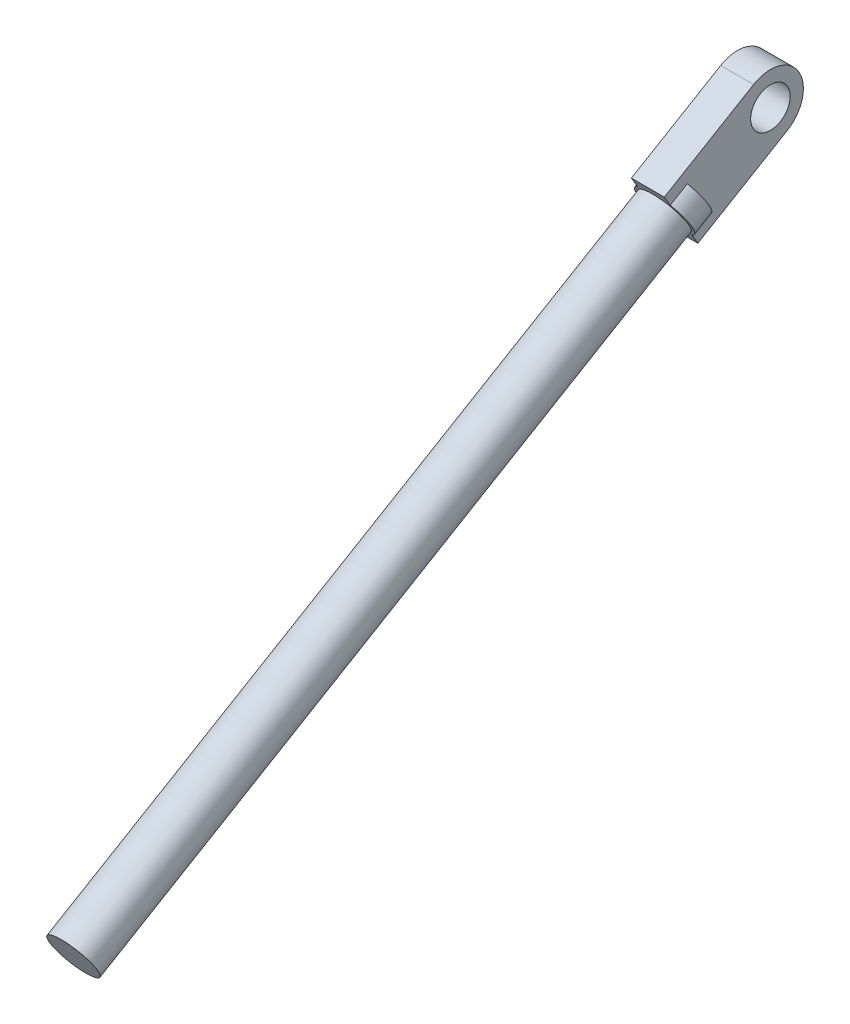
ISO-10303-21;
HEADER;
FILE_DESCRIPTION(('STEP AP214'),'2;1');
FILE_NAME('part.step','',(''),(''),'','','');
FILE_SCHEMA(('AUTOMOTIVE_DESIGN { 1 0 10303 214 1 1 1 1 }'));
ENDSEC;
DATA;
#1=APPLICATION_CONTEXT('core data for automotive mechanical design processes');
#2=APPLICATION_PROTOCOL_DEFINITION('international standard','automotive_design',2000,#1);
#3=PRODUCT_CONTEXT('',#1,'mechanical');
#4=PRODUCT('Part','Part','',(#3));
#5=PRODUCT_RELATED_PRODUCT_CATEGORY('part','',(#4));
#6=PRODUCT_DEFINITION_FORMATION('','',#4);
#7=PRODUCT_DEFINITION_CONTEXT('part definition',#1,'design');
#8=PRODUCT_DEFINITION('design','',#6,#7);
#9=PRODUCT_DEFINITION_SHAPE('','',#8);
#10=(LENGTH_UNIT() NAMED_UNIT(*) SI_UNIT(.MILLI.,.METRE.));
#11=(NAMED_UNIT(*) PLANE_ANGLE_UNIT() SI_UNIT($,.RADIAN.));
#12=(NAMED_UNIT(*) SI_UNIT($,.STERADIAN.) SOLID_ANGLE_UNIT());
#13=UNCERTAINTY_MEASURE_WITH_UNIT(LENGTH_MEASURE(1.E-05),#10,'distance_accuracy_value','');
#14=(GEOMETRIC_REPRESENTATION_CONTEXT(3) GLOBAL_UNCERTAINTY_ASSIGNED_CONTEXT((#13)) GLOBAL_UNIT_ASSIGNED_CONTEXT((#10,
#11,#12)) REPRESENTATION_CONTEXT('',''));
#15=CARTESIAN_POINT('',(0.,0.,0.));
#16=DIRECTION('',(0.,0.,1.));
#17=DIRECTION('',(1.,0.,0.));
#18=AXIS2_PLACEMENT_3D('',#15,#16,#17);
#19=CARTESIAN_POINT('',(2000.00000023834,3731.97065065785,-1839.87329482292));
#20=DIRECTION('',(0.,-0.509636954746252,0.860389548028663));
#21=DIRECTION('',(-1.,0.,0.));
#22=AXIS2_PLACEMENT_3D('',#19,#20,#21);
#23=PLANE('',#22);
#24=DIRECTION('',(0.,-0.860389548028663,-0.509636954746252));
#25=VECTOR('',#24,1.);
#26=CARTESIAN_POINT('',(1950.00000023829,3731.97065065785,-1839.87329482292));
#27=LINE('',#26,#25);
#28=CARTESIAN_POINT('',(1950.00000023829,3787.67578153245,-1806.87731837513));
#29=VERTEX_POINT('',#28);
#30=CARTESIAN_POINT('',(1950.00000023829,3676.26551978325,-1872.8692712707));
#31=VERTEX_POINT('',#30);
#32=EDGE_CURVE('E85',#29,#31,#27,.T.);
#33=ORIENTED_EDGE('',*,*,#32,.T.);
#34=CARTESIAN_POINT('',(2000.00000023834,3731.97065065785,-1839.87329482292));
#35=DIRECTION('',(0.,-0.509636954746252,0.860389548028663));
#36=DIRECTION('',(-1.,0.,0.));
#37=AXIS2_PLACEMENT_3D('',#34,#35,#36);
#38=CIRCLE('',#37,81.8033988750117);
#39=EDGE_CURVE('E19',#29,#31,#38,.T.);
#40=ORIENTED_EDGE('',*,*,#39,.F.);
#41=EDGE_LOOP('',(#33,#40));
#42=FACE_BOUND('',#41,.T.);
#43=ADVANCED_FACE('F16',(#42),#23,.F.);
#44=CARTESIAN_POINT('',(1950.00000023829,3861.92807411815,-2059.27262957024));
#45=DIRECTION('',(-1.,0.,0.));
#46=DIRECTION('',(0.,0.509636954746252,-0.860389548028663));
#47=AXIS2_PLACEMENT_3D('',#44,#45,#46);
#48=CYLINDRICAL_SURFACE('',#47,60.0000000000005);
#49=CARTESIAN_POINT('',(2050.00000023829,3861.92807411815,-2059.27262957024));
#50=DIRECTION('',(-1.,0.,0.));
#51=DIRECTION('',(0.,0.509636954746252,-0.860389548028663));
#52=AXIS2_PLACEMENT_3D('',#49,#50,#51);
#53=CIRCLE('',#52,60.0000000000005);
#54=CARTESIAN_POINT('',(2050.00000023829,3892.50629140292,-2110.89600245196));
#55=VERTEX_POINT('',#54);
#56=EDGE_CURVE('E115',#55,#55,#53,.T.);
#57=ORIENTED_EDGE('',*,*,#56,.F.);
#58=EDGE_LOOP('',(#57));
#59=FACE_BOUND('',#58,.T.);
#60=CARTESIAN_POINT('',(1950.00000023829,3861.92807411815,-2059.27262957024));
#61=DIRECTION('',(-1.,0.,0.));
#62=DIRECTION('',(0.,0.509636954746252,-0.860389548028663));
#63=AXIS2_PLACEMENT_3D('',#60,#61,#62);
#64=CIRCLE('',#63,60.0000000000005);
#65=CARTESIAN_POINT('',(1950.00000023829,3892.50629140292,-2110.89600245196));
#66=VERTEX_POINT('',#65);
#67=EDGE_CURVE('E83',#66,#66,#64,.T.);
#68=ORIENTED_EDGE('',*,*,#67,.T.);
#69=EDGE_LOOP('',(#68));
#70=FACE_BOUND('',#69,.T.);
#71=ADVANCED_FACE('F141',(#59,#70),#48,.F.);
#72=CARTESIAN_POINT('',(1950.00000023829,3861.92807411815,-2059.27262957024));
#73=DIRECTION('',(1.,0.,0.));
#74=DIRECTION('',(0.,-0.509636954746252,0.860389548028663));
#75=AXIS2_PLACEMENT_3D('',#72,#73,#74);
#76=CYLINDRICAL_SURFACE('',#75,99.9999999999996);
#77=CARTESIAN_POINT('',(1950.00000023829,3861.92807411815,-2059.27262957024));
#78=DIRECTION('',(1.,0.,0.));
#79=DIRECTION('',(0.,-0.509636954746252,0.860389548028663));
#80=AXIS2_PLACEMENT_3D('',#77,#78,#79);
#81=CIRCLE('',#80,99.9999999999996);
#82=CARTESIAN_POINT('',(1950.00000023829,3775.88911931528,-2110.23632504486));
#83=VERTEX_POINT('',#82);
#84=CARTESIAN_POINT('',(1950.00000023829,3947.96702892101,-2008.30893409561));
#85=VERTEX_POINT('',#84);
#86=EDGE_CURVE('E95',#83,#85,#81,.T.);
#87=ORIENTED_EDGE('',*,*,#86,.T.);
#88=DIRECTION('',(1.,0.,0.));
#89=VECTOR('',#88,1.);
#90=CARTESIAN_POINT('',(1950.00000023829,3947.96702892101,-2008.30893409561));
#91=LINE('',#90,#89);
#92=CARTESIAN_POINT('',(2050.00000023829,3947.96702892101,-2008.30893409561));
#93=VERTEX_POINT('',#92);
#94=EDGE_CURVE('E84',#93,#85,#91,.F.);
#95=ORIENTED_EDGE('',*,*,#94,.F.);
#96=CARTESIAN_POINT('',(2050.00000023829,3861.92807411815,-2059.27262957024));
#97=DIRECTION('',(1.,0.,0.));
#98=DIRECTION('',(0.,-0.509636954746252,0.860389548028663));
#99=AXIS2_PLACEMENT_3D('',#96,#97,#98);
#100=CIRCLE('',#99,99.9999999999996);
#101=CARTESIAN_POINT('',(2050.00000023829,3775.88911931528,-2110.23632504486));
#102=VERTEX_POINT('',#101);
#103=EDGE_CURVE('E132',#102,#93,#100,.T.);
#104=ORIENTED_EDGE('',*,*,#103,.F.);
#105=DIRECTION('',(1.,0.,0.));
#106=VECTOR('',#105,1.);
#107=CARTESIAN_POINT('',(1950.00000023829,3775.88911931528,-2110.23632504486));
#108=LINE('',#107,#106);
#109=EDGE_CURVE('E118',#83,#102,#108,.T.);
#110=ORIENTED_EDGE('',*,*,#109,.F.);
#111=EDGE_LOOP('',(#87,#95,#104,#110));
#112=FACE_BOUND('',#111,.T.);
#113=ADVANCED_FACE('F144',(#112),#76,.T.);
#114=CARTESIAN_POINT('',(2000.00000023834,3731.97065065785,-1839.87329482292));
#115=DIRECTION('',(0.,-0.509636954746252,0.860389548028663));
#116=DIRECTION('',(-1.,0.,0.));
#117=AXIS2_PLACEMENT_3D('',#114,#115,#116);
#118=PLANE('',#117);
#119=DIRECTION('',(0.,-0.860389548028663,-0.509636954746252));
#120=VECTOR('',#119,1.);
#121=CARTESIAN_POINT('',(2050.00000023829,3731.97065065785,-1839.87329482292));
#122=LINE('',#121,#120);
#123=CARTESIAN_POINT('',(2050.00000023829,3787.67578153252,-1806.8773183751));
#124=VERTEX_POINT('',#123);
#125=CARTESIAN_POINT('',(2050.00000023829,3676.26551978318,-1872.86927127074));
#126=VERTEX_POINT('',#125);
#127=EDGE_CURVE('E112',#124,#126,#122,.T.);
#128=ORIENTED_EDGE('',*,*,#127,.F.);
#129=CARTESIAN_POINT('',(2000.00000023834,3731.97065065785,-1839.87329482292));
#130=DIRECTION('',(0.,-0.509636954746252,0.860389548028663));
#131=DIRECTION('',(-1.,0.,0.));
#132=AXIS2_PLACEMENT_3D('',#129,#130,#131);
#133=CIRCLE('',#132,81.8033988750113);
#134=EDGE_CURVE('E128',#126,#124,#133,.T.);
#135=ORIENTED_EDGE('',*,*,#134,.F.);
#136=EDGE_LOOP('',(#128,#135));
#137=FACE_BOUND('',#136,.T.);
#138=ADVANCED_FACE('F230',(#137),#118,.F.);
#139=CARTESIAN_POINT('',(1950.00000023829,3947.96702892101,-2008.30893409561));
#140=DIRECTION('',(0.,0.860389548028663,0.509636954746252));
#141=DIRECTION('',(0.,-0.509636954746252,0.860389548028663));
#142=AXIS2_PLACEMENT_3D('',#139,#140,#141);
#143=PLANE('',#142);
#144=DIRECTION('',(0.,-0.509636954746252,0.860389548028663));
#145=VECTOR('',#144,1.);
#146=CARTESIAN_POINT('',(1950.00000023829,3947.96702892101,-2008.30893409561));
#147=LINE('',#146,#145);
#148=CARTESIAN_POINT('',(1950.00000023829,3787.43138817594,-1737.28622646657));
#149=VERTEX_POINT('',#148);
#150=EDGE_CURVE('E97',#85,#149,#147,.T.);
#151=ORIENTED_EDGE('',*,*,#150,.T.);
#152=DIRECTION('',(-1.,0.,0.));
#153=VECTOR('',#152,1.);
#154=CARTESIAN_POINT('',(1950.00000023829,3787.43138817594,-1737.28622646657));
#155=LINE('',#154,#153);
#156=CARTESIAN_POINT('',(2050.00000023829,3787.43138817594,-1737.28622646657));
#157=VERTEX_POINT('',#156);
#158=EDGE_CURVE('E105',#157,#149,#155,.T.);
#159=ORIENTED_EDGE('',*,*,#158,.F.);
#160=DIRECTION('',(0.,-0.509636954746252,0.860389548028663));
#161=VECTOR('',#160,1.);
#162=CARTESIAN_POINT('',(2050.00000023829,3947.96702892101,-2008.30893409561));
#163=LINE('',#162,#161);
#164=EDGE_CURVE('E135',#93,#157,#163,.T.);
#165=ORIENTED_EDGE('',*,*,#164,.F.);
#166=ORIENTED_EDGE('',*,*,#94,.T.);
#167=EDGE_LOOP('',(#151,#159,#165,#166));
#168=FACE_BOUND('',#167,.T.);
#169=ADVANCED_FACE('F156',(#168),#143,.T.);
#170=CARTESIAN_POINT('',(2000.00000023834,3731.97065065785,-1839.87329482292));
#171=DIRECTION('',(0.,-0.509636954746252,0.860389548028663));
#172=DIRECTION('',(-1.,0.,0.));
#173=AXIS2_PLACEMENT_3D('',#170,#171,#172);
#174=CYLINDRICAL_SURFACE('',#173,81.8033988750117);
#175=DIRECTION('',(0.,-0.509636954746252,0.860389548028663));
#176=VECTOR('',#175,1.);
#177=CARTESIAN_POINT('',(1950.00000023829,3806.22294324355,-2092.26860601802));
#178=LINE('',#177,#176);
#179=CARTESIAN_POINT('',(1950.00000023829,3645.68730249847,-1821.24589838898));
#180=VERTEX_POINT('',#179);
#181=EDGE_CURVE('E77',#31,#180,#178,.T.);
#182=ORIENTED_EDGE('',*,*,#181,.T.);
#183=CARTESIAN_POINT('',(2000.00000023834,3701.39243337307,-1788.2499219412));
#184=DIRECTION('',(0.,-0.509636954746252,0.860389548028663));
#185=DIRECTION('',(-1.,0.,0.));
#186=AXIS2_PLACEMENT_3D('',#183,#184,#185);
#187=CIRCLE('',#186,81.8033988750117);
#188=CARTESIAN_POINT('',(1950.00000023829,3757.09756424768,-1755.25394549341));
#189=VERTEX_POINT('',#188);
#190=EDGE_CURVE('E126',#189,#180,#187,.T.);
#191=ORIENTED_EDGE('',*,*,#190,.F.);
#192=DIRECTION('',(0.,-0.509636954746252,0.860389548028663));
#193=VECTOR('',#192,1.);
#194=CARTESIAN_POINT('',(1950.00000023829,3917.63320499275,-2026.27665312245));
#195=LINE('',#194,#193);
#196=EDGE_CURVE('E80',#189,#29,#195,.F.);
#197=ORIENTED_EDGE('',*,*,#196,.T.);
#198=ORIENTED_EDGE('',*,*,#39,.T.);
#199=EDGE_LOOP('',(#182,#191,#197,#198));
#200=FACE_BOUND('',#199,.T.);
#201=ADVANCED_FACE('F75',(#200),#174,.T.);
#202=CARTESIAN_POINT('',(1950.00000023829,3861.92807411815,-2059.27262957024));
#203=DIRECTION('',(1.,0.,0.));
#204=DIRECTION('',(0.,-0.509636954746252,0.860389548028663));
#205=AXIS2_PLACEMENT_3D('',#202,#203,#204);
#206=PLANE('',#205);
#207=ORIENTED_EDGE('',*,*,#196,.F.);
#208=DIRECTION('',(0.,-0.860389548028663,-0.509636954746252));
#209=VECTOR('',#208,1.);
#210=CARTESIAN_POINT('',(1950.00000023829,3787.43138817594,-1737.28622646657));
#211=LINE('',#210,#209);
#212=EDGE_CURVE('E108',#149,#189,#211,.T.);
#213=ORIENTED_EDGE('',*,*,#212,.F.);
#214=ORIENTED_EDGE('',*,*,#150,.F.);
#215=ORIENTED_EDGE('',*,*,#86,.F.);
#216=DIRECTION('',(0.,0.509636954746252,-0.860389548028663));
#217=VECTOR('',#216,1.);
#218=CARTESIAN_POINT('',(1950.00000023829,3615.35347857021,-1839.21361741583));
#219=LINE('',#218,#217);
#220=CARTESIAN_POINT('',(1950.00000023829,3615.35347857021,-1839.21361741583));
#221=VERTEX_POINT('',#220);
#222=EDGE_CURVE('E87',#221,#83,#219,.T.);
#223=ORIENTED_EDGE('',*,*,#222,.F.);
#224=DIRECTION('',(0.,-0.860389548028663,-0.509636954746252));
#225=VECTOR('',#224,1.);
#226=CARTESIAN_POINT('',(1950.00000023829,3787.43138817594,-1737.28622646657));
#227=LINE('',#226,#225);
#228=EDGE_CURVE('E93',#180,#221,#227,.T.);
#229=ORIENTED_EDGE('',*,*,#228,.F.);
#230=ORIENTED_EDGE('',*,*,#181,.F.);
#231=ORIENTED_EDGE('',*,*,#32,.F.);
#232=EDGE_LOOP('',(#207,#213,#214,#215,#223,#229,#230,#231));
#233=FACE_BOUND('',#232,.T.);
#234=ORIENTED_EDGE('',*,*,#67,.F.);
#235=EDGE_LOOP('',(#234));
#236=FACE_BOUND('',#235,.T.);
#237=ADVANCED_FACE('F89',(#233,#236),#206,.F.);
#238=CARTESIAN_POINT('',(1950.00000023829,3615.35347857021,-1839.21361741583));
#239=DIRECTION('',(0.,-0.860389548028663,-0.509636954746252));
#240=DIRECTION('',(0.,0.509636954746252,-0.860389548028663));
#241=AXIS2_PLACEMENT_3D('',#238,#239,#240);
#242=PLANE('',#241);
#243=ORIENTED_EDGE('',*,*,#222,.T.);
#244=ORIENTED_EDGE('',*,*,#109,.T.);
#245=DIRECTION('',(0.,-0.509636954746252,0.860389548028663));
#246=VECTOR('',#245,1.);
#247=CARTESIAN_POINT('',(2050.00000023829,3775.88911931528,-2110.23632504486));
#248=LINE('',#247,#246);
#249=CARTESIAN_POINT('',(2050.00000023829,3615.35347857021,-1839.21361741583));
#250=VERTEX_POINT('',#249);
#251=EDGE_CURVE('E114',#250,#102,#248,.F.);
#252=ORIENTED_EDGE('',*,*,#251,.F.);
#253=DIRECTION('',(-1.,0.,0.));
#254=VECTOR('',#253,1.);
#255=CARTESIAN_POINT('',(1950.00000023829,3615.35347857021,-1839.21361741583));
#256=LINE('',#255,#254);
#257=EDGE_CURVE('E212',#221,#250,#256,.F.);
#258=ORIENTED_EDGE('',*,*,#257,.F.);
#259=EDGE_LOOP('',(#243,#244,#252,#258));
#260=FACE_BOUND('',#259,.T.);
#261=ADVANCED_FACE('F147',(#260),#242,.T.);
#262=CARTESIAN_POINT('',(2050.00000023829,3861.92807411815,-2059.27262957024));
#263=DIRECTION('',(1.,0.,0.));
#264=DIRECTION('',(0.,-0.509636954746252,0.860389548028663));
#265=AXIS2_PLACEMENT_3D('',#262,#263,#264);
#266=PLANE('',#265);
#267=ORIENTED_EDGE('',*,*,#164,.T.);
#268=DIRECTION('',(0.,-0.860389548028663,-0.509636954746252));
#269=VECTOR('',#268,1.);
#270=CARTESIAN_POINT('',(2050.00000023829,3787.43138817594,-1737.28622646657));
#271=LINE('',#270,#269);
#272=CARTESIAN_POINT('',(2050.00000023829,3757.09756424774,-1755.25394549338));
#273=VERTEX_POINT('',#272);
#274=EDGE_CURVE('E109',#273,#157,#271,.F.);
#275=ORIENTED_EDGE('',*,*,#274,.F.);
#276=DIRECTION('',(0.,-0.509636954746252,0.860389548028663));
#277=VECTOR('',#276,1.);
#278=CARTESIAN_POINT('',(2050.00000023829,3787.67578153252,-1806.8773183751));
#279=LINE('',#278,#277);
#280=EDGE_CURVE('E131',#124,#273,#279,.T.);
#281=ORIENTED_EDGE('',*,*,#280,.F.);
#282=ORIENTED_EDGE('',*,*,#127,.T.);
#283=DIRECTION('',(0.,-0.509636954746252,0.860389548028663));
#284=VECTOR('',#283,1.);
#285=CARTESIAN_POINT('',(2050.00000023829,3676.26551978318,-1872.86927127074));
#286=LINE('',#285,#284);
#287=CARTESIAN_POINT('',(2050.00000023829,3645.68730249841,-1821.24589838902));
#288=VERTEX_POINT('',#287);
#289=EDGE_CURVE('E34',#288,#126,#286,.F.);
#290=ORIENTED_EDGE('',*,*,#289,.F.);
#291=DIRECTION('',(0.,-0.860389548028663,-0.509636954746252));
#292=VECTOR('',#291,1.);
#293=CARTESIAN_POINT('',(2050.00000023829,3787.43138817594,-1737.28622646657));
#294=LINE('',#293,#292);
#295=EDGE_CURVE('E125',#250,#288,#294,.F.);
#296=ORIENTED_EDGE('',*,*,#295,.F.);
#297=ORIENTED_EDGE('',*,*,#251,.T.);
#298=ORIENTED_EDGE('',*,*,#103,.T.);
#299=EDGE_LOOP('',(#267,#275,#281,#282,#290,#296,#297,#298));
#300=FACE_BOUND('',#299,.T.);
#301=ORIENTED_EDGE('',*,*,#56,.T.);
#302=EDGE_LOOP('',(#301));
#303=FACE_BOUND('',#302,.T.);
#304=ADVANCED_FACE('F139',(#300,#303),#266,.T.);
#305=CARTESIAN_POINT('',(2000.00000023834,3731.97065065785,-1839.87329482292));
#306=DIRECTION('',(0.,-0.509636954746252,0.860389548028663));
#307=DIRECTION('',(-1.,0.,0.));
#308=AXIS2_PLACEMENT_3D('',#305,#306,#307);
#309=CYLINDRICAL_SURFACE('',#308,81.8033988750113);
#310=ORIENTED_EDGE('',*,*,#134,.T.);
#311=ORIENTED_EDGE('',*,*,#280,.T.);
#312=CARTESIAN_POINT('',(2000.00000023834,3701.39243337307,-1788.2499219412));
#313=DIRECTION('',(0.,-0.509636954746252,0.860389548028663));
#314=DIRECTION('',(-1.,0.,0.));
#315=AXIS2_PLACEMENT_3D('',#312,#313,#314);
#316=CIRCLE('',#315,81.8033988750113);
#317=EDGE_CURVE('E122',#288,#273,#316,.T.);
#318=ORIENTED_EDGE('',*,*,#317,.F.);
#319=ORIENTED_EDGE('',*,*,#289,.T.);
#320=EDGE_LOOP('',(#310,#311,#318,#319));
#321=FACE_BOUND('',#320,.T.);
#322=ADVANCED_FACE('F173',(#321),#309,.T.);
#323=CARTESIAN_POINT('',(2072.50000023834,2638.79938272714,5.6622856985622));
#324=DIRECTION('',(0.,-0.509636954746252,0.860389548028663));
#325=DIRECTION('',(-1.,0.,0.));
#326=AXIS2_PLACEMENT_3D('',#323,#324,#325);
#327=PLANE('',#326);
#328=CARTESIAN_POINT('',(2000.00000023834,2638.79938272714,5.6622856985622));
#329=DIRECTION('',(0.,0.509636954746252,-0.860389548028663));
#330=DIRECTION('',(1.,0.,0.));
#331=AXIS2_PLACEMENT_3D('',#328,#329,#330);
#332=CIRCLE('',#331,72.5);
#333=CARTESIAN_POINT('',(2072.50000023834,2638.79938272714,5.6622856985622));
#334=VERTEX_POINT('',#333);
#335=EDGE_CURVE('E25',#334,#334,#332,.T.);
#336=ORIENTED_EDGE('',*,*,#335,.F.);
#337=EDGE_LOOP('',(#336));
#338=FACE_BOUND('',#337,.T.);
#339=ADVANCED_FACE('F166',(#338),#327,.T.);
#340=CARTESIAN_POINT('',(1950.00000023829,3787.43138817594,-1737.28622646657));
#341=DIRECTION('',(0.,-0.509636954746252,0.860389548028663));
#342=DIRECTION('',(-1.,0.,0.));
#343=AXIS2_PLACEMENT_3D('',#340,#341,#342);
#344=PLANE('',#343);
#345=ORIENTED_EDGE('',*,*,#295,.T.);
#346=ORIENTED_EDGE('',*,*,#317,.T.);
#347=ORIENTED_EDGE('',*,*,#274,.T.);
#348=ORIENTED_EDGE('',*,*,#158,.T.);
#349=ORIENTED_EDGE('',*,*,#212,.T.);
#350=ORIENTED_EDGE('',*,*,#190,.T.);
#351=ORIENTED_EDGE('',*,*,#228,.T.);
#352=ORIENTED_EDGE('',*,*,#257,.T.);
#353=EDGE_LOOP('',(#345,#346,#347,#348,#349,#350,#351,#352));
#354=FACE_BOUND('',#353,.T.);
#355=CARTESIAN_POINT('',(2000.00000023834,3701.39243337307,-1788.2499219412));
#356=DIRECTION('',(0.,0.509636954746252,-0.860389548028663));
#357=DIRECTION('',(1.,0.,0.));
#358=AXIS2_PLACEMENT_3D('',#355,#356,#357);
#359=CIRCLE('',#358,72.5);
#360=CARTESIAN_POINT('',(2072.50000023834,3701.39243337307,-1788.2499219412));
#361=VERTEX_POINT('',#360);
#362=EDGE_CURVE('E10',#361,#361,#359,.F.);
#363=ORIENTED_EDGE('',*,*,#362,.F.);
#364=EDGE_LOOP('',(#363));
#365=FACE_BOUND('',#364,.T.);
#366=ADVANCED_FACE('F160',(#354,#365),#344,.T.);
#367=CARTESIAN_POINT('',(2000.00000023834,2638.79938272714,5.6622856985622));
#368=DIRECTION('',(0.,0.509636954746252,-0.860389548028663));
#369=DIRECTION('',(1.,0.,0.));
#370=AXIS2_PLACEMENT_3D('',#367,#368,#369);
#371=CYLINDRICAL_SURFACE('',#370,72.5);
#372=ORIENTED_EDGE('',*,*,#362,.T.);
#373=EDGE_LOOP('',(#372));
#374=FACE_BOUND('',#373,.T.);
#375=ORIENTED_EDGE('',*,*,#335,.T.);
#376=EDGE_LOOP('',(#375));
#377=FACE_BOUND('',#376,.T.);
#378=ADVANCED_FACE('F158',(#374,#377),#371,.T.);
#379=CLOSED_SHELL('',(#43,#71,#113,#138,#169,#201,#237,#261,#304,#322,#339,#366,#378));
#380=MANIFOLD_SOLID_BREP('B1',#379);
#381=ADVANCED_BREP_SHAPE_REPRESENTATION('',(#18,#380),#14);
#382=SHAPE_DEFINITION_REPRESENTATION(#9,#381);
ENDSEC;
END-ISO-10303-21;
